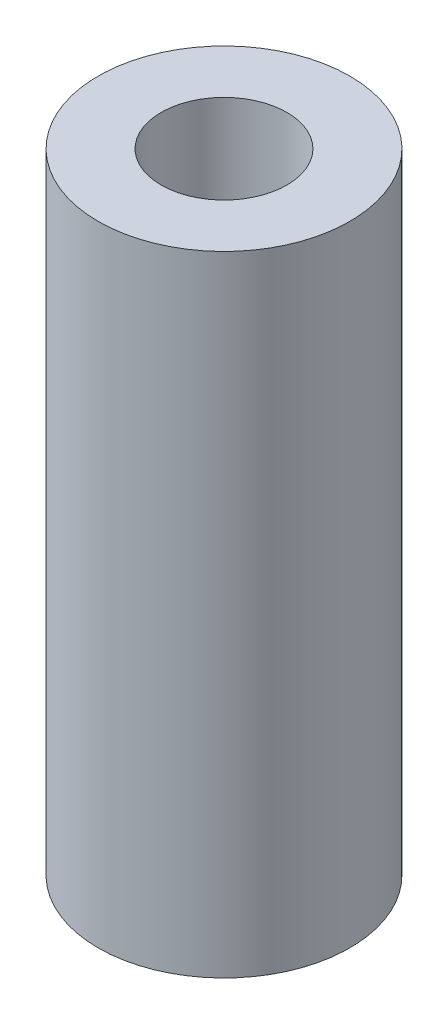
ISO-10303-21;
HEADER;
FILE_DESCRIPTION(('STEP AP214'),'2;1');
FILE_NAME('part.step','',(''),(''),'','','');
FILE_SCHEMA(('AUTOMOTIVE_DESIGN { 1 0 10303 214 1 1 1 1 }'));
ENDSEC;
DATA;
#1=APPLICATION_CONTEXT('core data for automotive mechanical design processes');
#2=APPLICATION_PROTOCOL_DEFINITION('international standard','automotive_design',2000,#1);
#3=PRODUCT_CONTEXT('',#1,'mechanical');
#4=PRODUCT('Part','Part','',(#3));
#5=PRODUCT_RELATED_PRODUCT_CATEGORY('part','',(#4));
#6=PRODUCT_DEFINITION_FORMATION('','',#4);
#7=PRODUCT_DEFINITION_CONTEXT('part definition',#1,'design');
#8=PRODUCT_DEFINITION('design','',#6,#7);
#9=PRODUCT_DEFINITION_SHAPE('','',#8);
#10=(LENGTH_UNIT() NAMED_UNIT(*) SI_UNIT(.MILLI.,.METRE.));
#11=(NAMED_UNIT(*) PLANE_ANGLE_UNIT() SI_UNIT($,.RADIAN.));
#12=(NAMED_UNIT(*) SI_UNIT($,.STERADIAN.) SOLID_ANGLE_UNIT());
#13=UNCERTAINTY_MEASURE_WITH_UNIT(LENGTH_MEASURE(1.E-05),#10,'distance_accuracy_value','');
#14=(GEOMETRIC_REPRESENTATION_CONTEXT(3) GLOBAL_UNCERTAINTY_ASSIGNED_CONTEXT((#13)) GLOBAL_UNIT_ASSIGNED_CONTEXT((#10,
#11,#12)) REPRESENTATION_CONTEXT('',''));
#15=CARTESIAN_POINT('',(0.,0.,0.));
#16=DIRECTION('',(0.,0.,1.));
#17=DIRECTION('',(1.,0.,0.));
#18=AXIS2_PLACEMENT_3D('',#15,#16,#17);
#19=CARTESIAN_POINT('',(0.,10.,0.));
#20=DIRECTION('',(0.,-1.,0.));
#21=DIRECTION('',(0.,0.,-1.));
#22=AXIS2_PLACEMENT_3D('',#19,#20,#21);
#23=CYLINDRICAL_SURFACE('',#22,2.);
#24=CARTESIAN_POINT('',(0.,10.,0.));
#25=DIRECTION('',(0.,1.,0.));
#26=DIRECTION('',(0.,0.,1.));
#27=AXIS2_PLACEMENT_3D('',#24,#25,#26);
#28=CIRCLE('',#27,2.);
#29=CARTESIAN_POINT('',(0.,10.,2.));
#30=VERTEX_POINT('',#29);
#31=EDGE_CURVE('E10',#30,#30,#28,.T.);
#32=ORIENTED_EDGE('',*,*,#31,.F.);
#33=EDGE_LOOP('',(#32));
#34=FACE_BOUND('',#33,.T.);
#35=CARTESIAN_POINT('',(0.,0.,0.));
#36=DIRECTION('',(0.,1.,0.));
#37=DIRECTION('',(0.,0.,1.));
#38=AXIS2_PLACEMENT_3D('',#35,#36,#37);
#39=CIRCLE('',#38,2.);
#40=CARTESIAN_POINT('',(0.,0.,2.));
#41=VERTEX_POINT('',#40);
#42=EDGE_CURVE('E38',#41,#41,#39,.T.);
#43=ORIENTED_EDGE('',*,*,#42,.T.);
#44=EDGE_LOOP('',(#43));
#45=FACE_BOUND('',#44,.T.);
#46=ADVANCED_FACE('F35',(#34,#45),#23,.T.);
#47=CARTESIAN_POINT('',(0.,10.,0.));
#48=DIRECTION('',(0.,1.,0.));
#49=DIRECTION('',(0.,0.,1.));
#50=AXIS2_PLACEMENT_3D('',#47,#48,#49);
#51=PLANE('',#50);
#52=CARTESIAN_POINT('',(0.,10.,0.));
#53=DIRECTION('',(0.,1.,0.));
#54=DIRECTION('',(0.,0.,1.));
#55=AXIS2_PLACEMENT_3D('',#52,#53,#54);
#56=CIRCLE('',#55,1.);
#57=CARTESIAN_POINT('',(0.,10.,1.));
#58=VERTEX_POINT('',#57);
#59=EDGE_CURVE('E47',#58,#58,#56,.T.);
#60=ORIENTED_EDGE('',*,*,#59,.F.);
#61=EDGE_LOOP('',(#60));
#62=FACE_BOUND('',#61,.T.);
#63=ORIENTED_EDGE('',*,*,#31,.T.);
#64=EDGE_LOOP('',(#63));
#65=FACE_BOUND('',#64,.T.);
#66=ADVANCED_FACE('F62',(#62,#65),#51,.T.);
#67=CARTESIAN_POINT('',(0.,0.,0.));
#68=DIRECTION('',(0.,1.,0.));
#69=DIRECTION('',(0.,0.,1.));
#70=AXIS2_PLACEMENT_3D('',#67,#68,#69);
#71=PLANE('',#70);
#72=CARTESIAN_POINT('',(0.,0.,0.));
#73=DIRECTION('',(0.,1.,0.));
#74=DIRECTION('',(0.,0.,1.));
#75=AXIS2_PLACEMENT_3D('',#72,#73,#74);
#76=CIRCLE('',#75,1.);
#77=CARTESIAN_POINT('',(0.,0.,1.));
#78=VERTEX_POINT('',#77);
#79=EDGE_CURVE('E45',#78,#78,#76,.T.);
#80=ORIENTED_EDGE('',*,*,#79,.T.);
#81=EDGE_LOOP('',(#80));
#82=FACE_BOUND('',#81,.T.);
#83=ORIENTED_EDGE('',*,*,#42,.F.);
#84=EDGE_LOOP('',(#83));
#85=FACE_BOUND('',#84,.T.);
#86=ADVANCED_FACE('F53',(#82,#85),#71,.F.);
#87=CARTESIAN_POINT('',(0.,0.,0.));
#88=DIRECTION('',(0.,1.,0.));
#89=DIRECTION('',(0.,0.,1.));
#90=AXIS2_PLACEMENT_3D('',#87,#88,#89);
#91=CYLINDRICAL_SURFACE('',#90,1.);
#92=ORIENTED_EDGE('',*,*,#79,.F.);
#93=EDGE_LOOP('',(#92));
#94=FACE_BOUND('',#93,.T.);
#95=ORIENTED_EDGE('',*,*,#59,.T.);
#96=EDGE_LOOP('',(#95));
#97=FACE_BOUND('',#96,.T.);
#98=ADVANCED_FACE('F56',(#94,#97),#91,.F.);
#99=CLOSED_SHELL('',(#46,#66,#86,#98));
#100=MANIFOLD_SOLID_BREP('B2',#99);
#101=ADVANCED_BREP_SHAPE_REPRESENTATION('',(#18,#100),#14);
#102=SHAPE_DEFINITION_REPRESENTATION(#9,#101);
ENDSEC;
END-ISO-10303-21;
